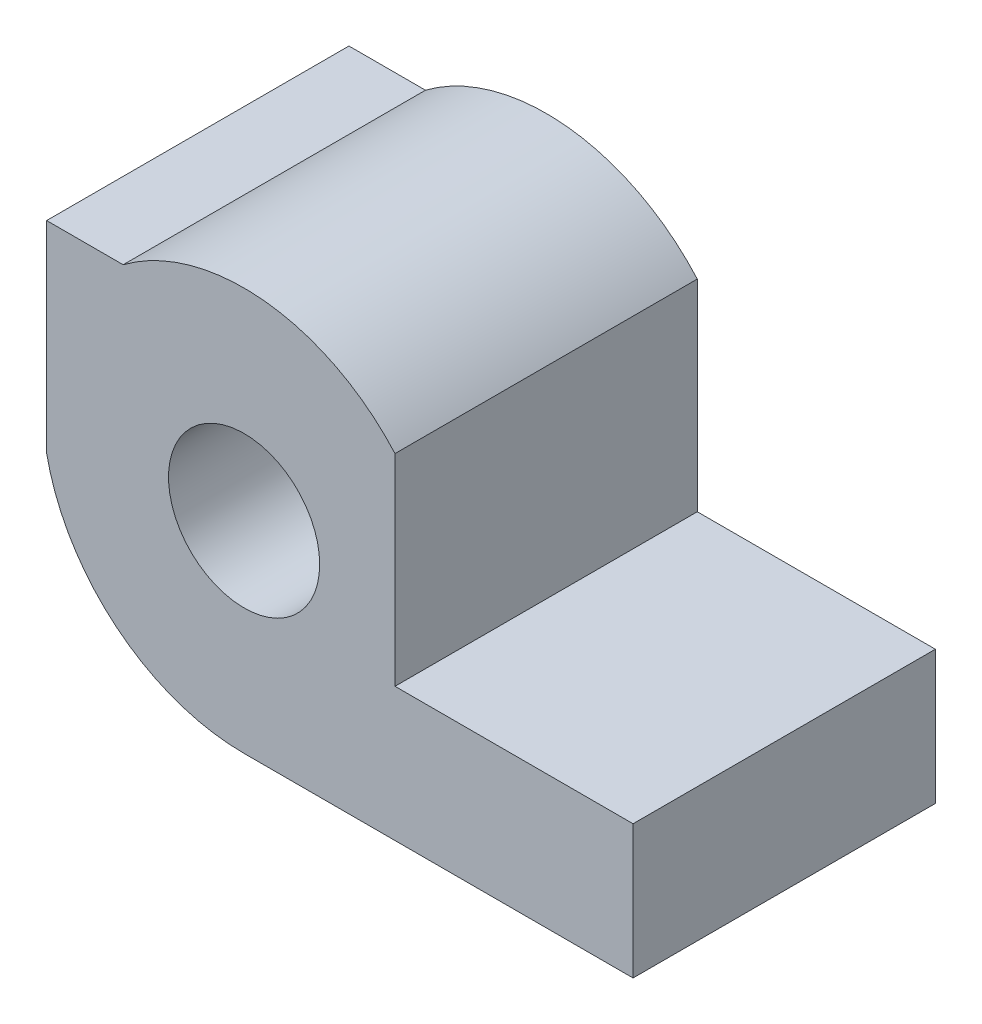
ISO-10303-21;
HEADER;
FILE_DESCRIPTION(('STEP AP214'),'2;1');
FILE_NAME('part.step','',(''),(''),'','','');
FILE_SCHEMA(('AUTOMOTIVE_DESIGN { 1 0 10303 214 1 1 1 1 }'));
ENDSEC;
DATA;
#1=APPLICATION_CONTEXT('core data for automotive mechanical design processes');
#2=APPLICATION_PROTOCOL_DEFINITION('international standard','automotive_design',2000,#1);
#3=PRODUCT_CONTEXT('',#1,'mechanical');
#4=PRODUCT('Part','Part','',(#3));
#5=PRODUCT_RELATED_PRODUCT_CATEGORY('part','',(#4));
#6=PRODUCT_DEFINITION_FORMATION('','',#4);
#7=PRODUCT_DEFINITION_CONTEXT('part definition',#1,'design');
#8=PRODUCT_DEFINITION('design','',#6,#7);
#9=PRODUCT_DEFINITION_SHAPE('','',#8);
#10=(LENGTH_UNIT() NAMED_UNIT(*) SI_UNIT(.MILLI.,.METRE.));
#11=(NAMED_UNIT(*) PLANE_ANGLE_UNIT() SI_UNIT($,.RADIAN.));
#12=(NAMED_UNIT(*) SI_UNIT($,.STERADIAN.) SOLID_ANGLE_UNIT());
#13=UNCERTAINTY_MEASURE_WITH_UNIT(LENGTH_MEASURE(1.E-05),#10,'distance_accuracy_value','');
#14=(GEOMETRIC_REPRESENTATION_CONTEXT(3) GLOBAL_UNCERTAINTY_ASSIGNED_CONTEXT((#13)) GLOBAL_UNIT_ASSIGNED_CONTEXT((#10,
#11,#12)) REPRESENTATION_CONTEXT('',''));
#15=CARTESIAN_POINT('',(0.,0.,0.));
#16=DIRECTION('',(0.,0.,1.));
#17=DIRECTION('',(1.,0.,0.));
#18=AXIS2_PLACEMENT_3D('',#15,#16,#17);
#19=CARTESIAN_POINT('',(0.599591794226535,0.,6.));
#20=DIRECTION('',(0.,0.,1.));
#21=DIRECTION('',(1.,0.,0.));
#22=AXIS2_PLACEMENT_3D('',#19,#20,#21);
#23=PLANE('',#22);
#24=CARTESIAN_POINT('',(0.599591794226535,0.,6.));
#25=DIRECTION('',(0.,0.,1.));
#26=DIRECTION('',(1.,0.,0.));
#27=AXIS2_PLACEMENT_3D('',#24,#25,#26);
#28=CIRCLE('',#27,3.99999999999998);
#29=CARTESIAN_POINT('',(-3.31959179422655,-0.799999999999803,6.));
#30=VERTEX_POINT('',#29);
#31=CARTESIAN_POINT('',(0.599591794226577,-4.,6.));
#32=VERTEX_POINT('',#31);
#33=EDGE_CURVE('E144',#30,#32,#28,.T.);
#34=ORIENTED_EDGE('',*,*,#33,.T.);
#35=DIRECTION('',(1.,0.,0.));
#36=VECTOR('',#35,1.);
#37=CARTESIAN_POINT('',(8.31959179422655,-4.,6.));
#38=LINE('',#37,#36);
#39=CARTESIAN_POINT('',(8.31959179422655,-4.,6.));
#40=VERTEX_POINT('',#39);
#41=EDGE_CURVE('E92',#32,#40,#38,.T.);
#42=ORIENTED_EDGE('',*,*,#41,.T.);
#43=DIRECTION('',(0.,1.,0.));
#44=VECTOR('',#43,1.);
#45=CARTESIAN_POINT('',(8.31959179422655,-1.34852681521835,6.));
#46=LINE('',#45,#44);
#47=CARTESIAN_POINT('',(8.31959179422655,-1.34852681521835,6.));
#48=VERTEX_POINT('',#47);
#49=EDGE_CURVE('E159',#40,#48,#46,.T.);
#50=ORIENTED_EDGE('',*,*,#49,.T.);
#51=DIRECTION('',(-1.,0.,0.));
#52=VECTOR('',#51,1.);
#53=CARTESIAN_POINT('',(3.59453585887705,-1.34852681521835,6.));
#54=LINE('',#53,#52);
#55=CARTESIAN_POINT('',(3.59453585887705,-1.34852681521835,6.));
#56=VERTEX_POINT('',#55);
#57=EDGE_CURVE('E172',#48,#56,#54,.T.);
#58=ORIENTED_EDGE('',*,*,#57,.T.);
#59=DIRECTION('',(0.,1.,0.));
#60=VECTOR('',#59,1.);
#61=CARTESIAN_POINT('',(3.59453585887705,2.65147318478138,6.));
#62=LINE('',#61,#60);
#63=CARTESIAN_POINT('',(3.59453585887705,2.65147318478138,6.));
#64=VERTEX_POINT('',#63);
#65=EDGE_CURVE('E111',#56,#64,#62,.T.);
#66=ORIENTED_EDGE('',*,*,#65,.T.);
#67=CARTESIAN_POINT('',(0.599591794226535,0.,6.));
#68=DIRECTION('',(0.,0.,1.));
#69=DIRECTION('',(1.,0.,0.));
#70=AXIS2_PLACEMENT_3D('',#67,#68,#69);
#71=CIRCLE('',#70,4.);
#72=CARTESIAN_POINT('',(-1.80040820577347,3.2,6.));
#73=VERTEX_POINT('',#72);
#74=EDGE_CURVE('E105',#64,#73,#71,.T.);
#75=ORIENTED_EDGE('',*,*,#74,.T.);
#76=DIRECTION('',(-1.,0.,0.));
#77=VECTOR('',#76,1.);
#78=CARTESIAN_POINT('',(-3.31959179422655,3.2,6.));
#79=LINE('',#78,#77);
#80=CARTESIAN_POINT('',(-3.31959179422655,3.2,6.));
#81=VERTEX_POINT('',#80);
#82=EDGE_CURVE('E109',#73,#81,#79,.T.);
#83=ORIENTED_EDGE('',*,*,#82,.T.);
#84=DIRECTION('',(0.,-1.,0.));
#85=VECTOR('',#84,1.);
#86=CARTESIAN_POINT('',(-3.31959179422655,3.2,6.));
#87=LINE('',#86,#85);
#88=EDGE_CURVE('E49',#81,#30,#87,.T.);
#89=ORIENTED_EDGE('',*,*,#88,.T.);
#90=EDGE_LOOP('',(#34,#42,#50,#58,#66,#75,#83,#89));
#91=FACE_BOUND('',#90,.T.);
#92=CARTESIAN_POINT('',(0.599591794226535,0.,6.));
#93=DIRECTION('',(0.,0.,1.));
#94=DIRECTION('',(1.,0.,0.));
#95=AXIS2_PLACEMENT_3D('',#92,#93,#94);
#96=CIRCLE('',#95,1.5);
#97=CARTESIAN_POINT('',(2.09959179422654,0.,6.));
#98=VERTEX_POINT('',#97);
#99=EDGE_CURVE('E133',#98,#98,#96,.T.);
#100=ORIENTED_EDGE('',*,*,#99,.F.);
#101=EDGE_LOOP('',(#100));
#102=FACE_BOUND('',#101,.T.);
#103=ADVANCED_FACE('F32',(#91,#102),#23,.T.);
#104=CARTESIAN_POINT('',(0.599591794226535,0.,0.));
#105=DIRECTION('',(0.,0.,1.));
#106=DIRECTION('',(1.,0.,0.));
#107=AXIS2_PLACEMENT_3D('',#104,#105,#106);
#108=PLANE('',#107);
#109=CARTESIAN_POINT('',(0.599591794226535,0.,0.));
#110=DIRECTION('',(0.,0.,1.));
#111=DIRECTION('',(1.,0.,0.));
#112=AXIS2_PLACEMENT_3D('',#109,#110,#111);
#113=CIRCLE('',#112,3.99999999999998);
#114=CARTESIAN_POINT('',(-3.31959179422655,-0.799999999999803,0.));
#115=VERTEX_POINT('',#114);
#116=CARTESIAN_POINT('',(0.599591794226577,-4.,0.));
#117=VERTEX_POINT('',#116);
#118=EDGE_CURVE('E129',#115,#117,#113,.T.);
#119=ORIENTED_EDGE('',*,*,#118,.F.);
#120=DIRECTION('',(0.,-1.,0.));
#121=VECTOR('',#120,1.);
#122=CARTESIAN_POINT('',(-3.31959179422655,3.2,0.));
#123=LINE('',#122,#121);
#124=CARTESIAN_POINT('',(-3.31959179422655,3.2,0.));
#125=VERTEX_POINT('',#124);
#126=EDGE_CURVE('E84',#125,#115,#123,.T.);
#127=ORIENTED_EDGE('',*,*,#126,.F.);
#128=DIRECTION('',(-1.,0.,0.));
#129=VECTOR('',#128,1.);
#130=CARTESIAN_POINT('',(-3.31959179422655,3.2,0.));
#131=LINE('',#130,#129);
#132=CARTESIAN_POINT('',(-1.80040820577347,3.2,0.));
#133=VERTEX_POINT('',#132);
#134=EDGE_CURVE('E78',#133,#125,#131,.T.);
#135=ORIENTED_EDGE('',*,*,#134,.F.);
#136=CARTESIAN_POINT('',(0.599591794226535,0.,0.));
#137=DIRECTION('',(0.,0.,1.));
#138=DIRECTION('',(1.,0.,0.));
#139=AXIS2_PLACEMENT_3D('',#136,#137,#138);
#140=CIRCLE('',#139,4.);
#141=CARTESIAN_POINT('',(3.59453585887705,2.65147318478138,0.));
#142=VERTEX_POINT('',#141);
#143=EDGE_CURVE('E119',#142,#133,#140,.T.);
#144=ORIENTED_EDGE('',*,*,#143,.F.);
#145=DIRECTION('',(0.,1.,0.));
#146=VECTOR('',#145,1.);
#147=CARTESIAN_POINT('',(3.59453585887705,2.65147318478138,0.));
#148=LINE('',#147,#146);
#149=CARTESIAN_POINT('',(3.59453585887705,-1.34852681521835,0.));
#150=VERTEX_POINT('',#149);
#151=EDGE_CURVE('E139',#150,#142,#148,.T.);
#152=ORIENTED_EDGE('',*,*,#151,.F.);
#153=DIRECTION('',(-1.,0.,0.));
#154=VECTOR('',#153,1.);
#155=CARTESIAN_POINT('',(3.59453585887705,-1.34852681521835,0.));
#156=LINE('',#155,#154);
#157=CARTESIAN_POINT('',(8.31959179422655,-1.34852681521835,0.));
#158=VERTEX_POINT('',#157);
#159=EDGE_CURVE('E137',#158,#150,#156,.T.);
#160=ORIENTED_EDGE('',*,*,#159,.F.);
#161=DIRECTION('',(0.,1.,0.));
#162=VECTOR('',#161,1.);
#163=CARTESIAN_POINT('',(8.31959179422655,-1.34852681521835,0.));
#164=LINE('',#163,#162);
#165=CARTESIAN_POINT('',(8.31959179422655,-4.,0.));
#166=VERTEX_POINT('',#165);
#167=EDGE_CURVE('E135',#166,#158,#164,.T.);
#168=ORIENTED_EDGE('',*,*,#167,.F.);
#169=DIRECTION('',(1.,0.,0.));
#170=VECTOR('',#169,1.);
#171=CARTESIAN_POINT('',(8.31959179422655,-4.,0.));
#172=LINE('',#171,#170);
#173=EDGE_CURVE('E132',#117,#166,#172,.T.);
#174=ORIENTED_EDGE('',*,*,#173,.F.);
#175=EDGE_LOOP('',(#119,#127,#135,#144,#152,#160,#168,#174));
#176=FACE_BOUND('',#175,.T.);
#177=CARTESIAN_POINT('',(0.599591794226535,0.,0.));
#178=DIRECTION('',(0.,0.,1.));
#179=DIRECTION('',(1.,0.,0.));
#180=AXIS2_PLACEMENT_3D('',#177,#178,#179);
#181=CIRCLE('',#180,1.5);
#182=CARTESIAN_POINT('',(2.09959179422654,0.,0.));
#183=VERTEX_POINT('',#182);
#184=EDGE_CURVE('E178',#183,#183,#181,.T.);
#185=ORIENTED_EDGE('',*,*,#184,.T.);
#186=EDGE_LOOP('',(#185));
#187=FACE_BOUND('',#186,.T.);
#188=ADVANCED_FACE('F163',(#176,#187),#108,.F.);
#189=CARTESIAN_POINT('',(0.599591794226535,0.,6.));
#190=DIRECTION('',(0.,0.,-1.));
#191=DIRECTION('',(-1.,0.,0.));
#192=AXIS2_PLACEMENT_3D('',#189,#190,#191);
#193=CYLINDRICAL_SURFACE('',#192,3.99999999999998);
#194=ORIENTED_EDGE('',*,*,#118,.T.);
#195=DIRECTION('',(0.,0.,-1.));
#196=VECTOR('',#195,1.);
#197=CARTESIAN_POINT('',(0.599591794226577,-4.,6.));
#198=LINE('',#197,#196);
#199=EDGE_CURVE('E11',#32,#117,#198,.T.);
#200=ORIENTED_EDGE('',*,*,#199,.F.);
#201=ORIENTED_EDGE('',*,*,#33,.F.);
#202=DIRECTION('',(0.,0.,-1.));
#203=VECTOR('',#202,1.);
#204=CARTESIAN_POINT('',(-3.31959179422655,-0.799999999999803,6.));
#205=LINE('',#204,#203);
#206=EDGE_CURVE('E125',#30,#115,#205,.T.);
#207=ORIENTED_EDGE('',*,*,#206,.T.);
#208=EDGE_LOOP('',(#194,#200,#201,#207));
#209=FACE_BOUND('',#208,.T.);
#210=ADVANCED_FACE('F34',(#209),#193,.T.);
#211=CARTESIAN_POINT('',(8.31959179422655,-4.,6.));
#212=DIRECTION('',(0.,1.,0.));
#213=DIRECTION('',(0.,0.,1.));
#214=AXIS2_PLACEMENT_3D('',#211,#212,#213);
#215=PLANE('',#214);
#216=ORIENTED_EDGE('',*,*,#173,.T.);
#217=DIRECTION('',(0.,0.,-1.));
#218=VECTOR('',#217,1.);
#219=CARTESIAN_POINT('',(8.31959179422655,-4.,6.));
#220=LINE('',#219,#218);
#221=EDGE_CURVE('E41',#40,#166,#220,.T.);
#222=ORIENTED_EDGE('',*,*,#221,.F.);
#223=ORIENTED_EDGE('',*,*,#41,.F.);
#224=ORIENTED_EDGE('',*,*,#199,.T.);
#225=EDGE_LOOP('',(#216,#222,#223,#224));
#226=FACE_BOUND('',#225,.T.);
#227=ADVANCED_FACE('F206',(#226),#215,.F.);
#228=CARTESIAN_POINT('',(8.31959179422655,-1.34852681521835,6.));
#229=DIRECTION('',(-1.,0.,0.));
#230=DIRECTION('',(0.,0.,1.));
#231=AXIS2_PLACEMENT_3D('',#228,#229,#230);
#232=PLANE('',#231);
#233=ORIENTED_EDGE('',*,*,#167,.T.);
#234=DIRECTION('',(0.,0.,-1.));
#235=VECTOR('',#234,1.);
#236=CARTESIAN_POINT('',(8.31959179422655,-1.34852681521835,6.));
#237=LINE('',#236,#235);
#238=EDGE_CURVE('E151',#48,#158,#237,.T.);
#239=ORIENTED_EDGE('',*,*,#238,.F.);
#240=ORIENTED_EDGE('',*,*,#49,.F.);
#241=ORIENTED_EDGE('',*,*,#221,.T.);
#242=EDGE_LOOP('',(#233,#239,#240,#241));
#243=FACE_BOUND('',#242,.T.);
#244=ADVANCED_FACE('F157',(#243),#232,.F.);
#245=CARTESIAN_POINT('',(3.59453585887705,-1.34852681521835,6.));
#246=DIRECTION('',(0.,-1.,0.));
#247=DIRECTION('',(0.,0.,-1.));
#248=AXIS2_PLACEMENT_3D('',#245,#246,#247);
#249=PLANE('',#248);
#250=ORIENTED_EDGE('',*,*,#159,.T.);
#251=DIRECTION('',(0.,0.,-1.));
#252=VECTOR('',#251,1.);
#253=CARTESIAN_POINT('',(3.59453585887705,-1.34852681521835,6.));
#254=LINE('',#253,#252);
#255=EDGE_CURVE('E148',#56,#150,#254,.T.);
#256=ORIENTED_EDGE('',*,*,#255,.F.);
#257=ORIENTED_EDGE('',*,*,#57,.F.);
#258=ORIENTED_EDGE('',*,*,#238,.T.);
#259=EDGE_LOOP('',(#250,#256,#257,#258));
#260=FACE_BOUND('',#259,.T.);
#261=ADVANCED_FACE('F168',(#260),#249,.F.);
#262=CARTESIAN_POINT('',(3.59453585887705,2.65147318478138,6.));
#263=DIRECTION('',(-1.,0.,0.));
#264=DIRECTION('',(0.,-1.,0.));
#265=AXIS2_PLACEMENT_3D('',#262,#263,#264);
#266=PLANE('',#265);
#267=ORIENTED_EDGE('',*,*,#151,.T.);
#268=DIRECTION('',(0.,0.,-1.));
#269=VECTOR('',#268,1.);
#270=CARTESIAN_POINT('',(3.59453585887705,2.65147318478138,6.));
#271=LINE('',#270,#269);
#272=EDGE_CURVE('E120',#64,#142,#271,.T.);
#273=ORIENTED_EDGE('',*,*,#272,.F.);
#274=ORIENTED_EDGE('',*,*,#65,.F.);
#275=ORIENTED_EDGE('',*,*,#255,.T.);
#276=EDGE_LOOP('',(#267,#273,#274,#275));
#277=FACE_BOUND('',#276,.T.);
#278=ADVANCED_FACE('F171',(#277),#266,.F.);
#279=CARTESIAN_POINT('',(0.599591794226535,0.,6.));
#280=DIRECTION('',(0.,0.,-1.));
#281=DIRECTION('',(-1.,0.,0.));
#282=AXIS2_PLACEMENT_3D('',#279,#280,#281);
#283=CYLINDRICAL_SURFACE('',#282,4.);
#284=ORIENTED_EDGE('',*,*,#143,.T.);
#285=DIRECTION('',(0.,0.,-1.));
#286=VECTOR('',#285,1.);
#287=CARTESIAN_POINT('',(-1.80040820577347,3.2,6.));
#288=LINE('',#287,#286);
#289=EDGE_CURVE('E116',#73,#133,#288,.T.);
#290=ORIENTED_EDGE('',*,*,#289,.F.);
#291=ORIENTED_EDGE('',*,*,#74,.F.);
#292=ORIENTED_EDGE('',*,*,#272,.T.);
#293=EDGE_LOOP('',(#284,#290,#291,#292));
#294=FACE_BOUND('',#293,.T.);
#295=ADVANCED_FACE('F117',(#294),#283,.T.);
#296=CARTESIAN_POINT('',(-3.31959179422655,3.2,6.));
#297=DIRECTION('',(0.,-1.,0.));
#298=DIRECTION('',(0.,0.,-1.));
#299=AXIS2_PLACEMENT_3D('',#296,#297,#298);
#300=PLANE('',#299);
#301=ORIENTED_EDGE('',*,*,#134,.T.);
#302=DIRECTION('',(0.,0.,-1.));
#303=VECTOR('',#302,1.);
#304=CARTESIAN_POINT('',(-3.31959179422655,3.2,6.));
#305=LINE('',#304,#303);
#306=EDGE_CURVE('E121',#81,#125,#305,.T.);
#307=ORIENTED_EDGE('',*,*,#306,.F.);
#308=ORIENTED_EDGE('',*,*,#82,.F.);
#309=ORIENTED_EDGE('',*,*,#289,.T.);
#310=EDGE_LOOP('',(#301,#307,#308,#309));
#311=FACE_BOUND('',#310,.T.);
#312=ADVANCED_FACE('F123',(#311),#300,.F.);
#313=CARTESIAN_POINT('',(-3.31959179422655,3.2,6.));
#314=DIRECTION('',(1.,0.,0.));
#315=DIRECTION('',(0.,0.,-1.));
#316=AXIS2_PLACEMENT_3D('',#313,#314,#315);
#317=PLANE('',#316);
#318=ORIENTED_EDGE('',*,*,#126,.T.);
#319=ORIENTED_EDGE('',*,*,#206,.F.);
#320=ORIENTED_EDGE('',*,*,#88,.F.);
#321=ORIENTED_EDGE('',*,*,#306,.T.);
#322=EDGE_LOOP('',(#318,#319,#320,#321));
#323=FACE_BOUND('',#322,.T.);
#324=ADVANCED_FACE('F194',(#323),#317,.F.);
#325=CARTESIAN_POINT('',(0.599591794226535,0.,6.));
#326=DIRECTION('',(0.,0.,-1.));
#327=DIRECTION('',(-1.,0.,0.));
#328=AXIS2_PLACEMENT_3D('',#325,#326,#327);
#329=CYLINDRICAL_SURFACE('',#328,1.5);
#330=ORIENTED_EDGE('',*,*,#99,.T.);
#331=EDGE_LOOP('',(#330));
#332=FACE_BOUND('',#331,.T.);
#333=ORIENTED_EDGE('',*,*,#184,.F.);
#334=EDGE_LOOP('',(#333));
#335=FACE_BOUND('',#334,.T.);
#336=ADVANCED_FACE('F184',(#332,#335),#329,.F.);
#337=CLOSED_SHELL('',(#103,#188,#210,#227,#244,#261,#278,#295,#312,#324,#336));
#338=MANIFOLD_SOLID_BREP('B2',#337);
#339=ADVANCED_BREP_SHAPE_REPRESENTATION('',(#18,#338),#14);
#340=SHAPE_DEFINITION_REPRESENTATION(#9,#339);
ENDSEC;
END-ISO-10303-21;
